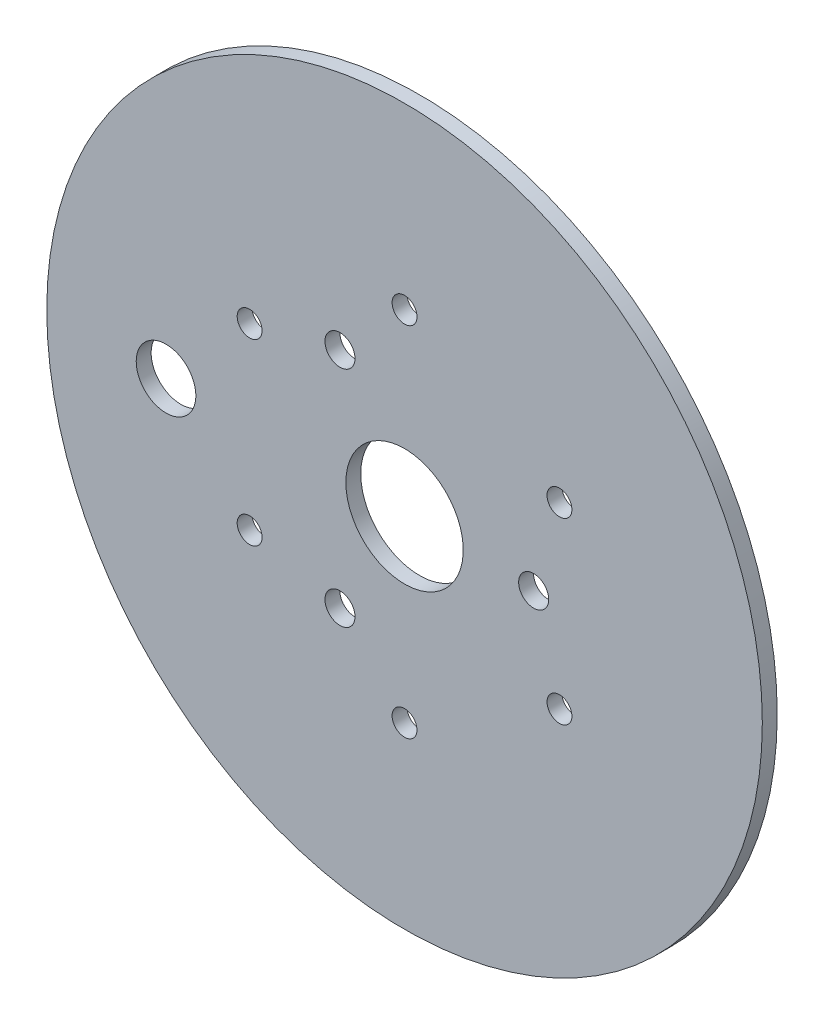
ISO-10303-21;
HEADER;
FILE_DESCRIPTION(('STEP AP214'),'2;1');
FILE_NAME('part.step','',(''),(''),'','','');
FILE_SCHEMA(('AUTOMOTIVE_DESIGN { 1 0 10303 214 1 1 1 1 }'));
ENDSEC;
DATA;
#1=APPLICATION_CONTEXT('core data for automotive mechanical design processes');
#2=APPLICATION_PROTOCOL_DEFINITION('international standard','automotive_design',2000,#1);
#3=PRODUCT_CONTEXT('',#1,'mechanical');
#4=PRODUCT('Part','Part','',(#3));
#5=PRODUCT_RELATED_PRODUCT_CATEGORY('part','',(#4));
#6=PRODUCT_DEFINITION_FORMATION('','',#4);
#7=PRODUCT_DEFINITION_CONTEXT('part definition',#1,'design');
#8=PRODUCT_DEFINITION('design','',#6,#7);
#9=PRODUCT_DEFINITION_SHAPE('','',#8);
#10=(LENGTH_UNIT() NAMED_UNIT(*) SI_UNIT(.MILLI.,.METRE.));
#11=(NAMED_UNIT(*) PLANE_ANGLE_UNIT() SI_UNIT($,.RADIAN.));
#12=(NAMED_UNIT(*) SI_UNIT($,.STERADIAN.) SOLID_ANGLE_UNIT());
#13=UNCERTAINTY_MEASURE_WITH_UNIT(LENGTH_MEASURE(1.E-05),#10,'distance_accuracy_value','');
#14=(GEOMETRIC_REPRESENTATION_CONTEXT(3) GLOBAL_UNCERTAINTY_ASSIGNED_CONTEXT((#13)) GLOBAL_UNIT_ASSIGNED_CONTEXT((#10,
#11,#12)) REPRESENTATION_CONTEXT('',''));
#15=CARTESIAN_POINT('',(0.,0.,0.));
#16=DIRECTION('',(0.,0.,1.));
#17=DIRECTION('',(1.,0.,0.));
#18=AXIS2_PLACEMENT_3D('',#15,#16,#17);
#19=CARTESIAN_POINT('',(0.,0.,3.175));
#20=DIRECTION('',(0.,0.,-1.));
#21=DIRECTION('',(-1.,0.,0.));
#22=AXIS2_PLACEMENT_3D('',#19,#20,#21);
#23=CYLINDRICAL_SURFACE('',#22,76.2);
#24=CARTESIAN_POINT('',(0.,0.,3.175));
#25=DIRECTION('',(0.,0.,1.));
#26=DIRECTION('',(1.,0.,0.));
#27=AXIS2_PLACEMENT_3D('',#24,#25,#26);
#28=CIRCLE('',#27,76.2);
#29=CARTESIAN_POINT('',(76.2,0.,3.175));
#30=VERTEX_POINT('',#29);
#31=EDGE_CURVE('E10',#30,#30,#28,.T.);
#32=ORIENTED_EDGE('',*,*,#31,.F.);
#33=EDGE_LOOP('',(#32));
#34=FACE_BOUND('',#33,.T.);
#35=CARTESIAN_POINT('',(0.,0.,0.));
#36=DIRECTION('',(0.,0.,1.));
#37=DIRECTION('',(1.,0.,0.));
#38=AXIS2_PLACEMENT_3D('',#35,#36,#37);
#39=CIRCLE('',#38,76.2);
#40=CARTESIAN_POINT('',(76.2,0.,0.));
#41=VERTEX_POINT('',#40);
#42=EDGE_CURVE('E44',#41,#41,#39,.T.);
#43=ORIENTED_EDGE('',*,*,#42,.T.);
#44=EDGE_LOOP('',(#43));
#45=FACE_BOUND('',#44,.T.);
#46=ADVANCED_FACE('F36',(#34,#45),#23,.T.);
#47=CARTESIAN_POINT('',(0.,0.,3.175));
#48=DIRECTION('',(0.,0.,1.));
#49=DIRECTION('',(1.,0.,0.));
#50=AXIS2_PLACEMENT_3D('',#47,#48,#49);
#51=PLANE('',#50);
#52=CARTESIAN_POINT('',(-50.8,0.,3.175));
#53=DIRECTION('',(0.,0.,-1.));
#54=DIRECTION('',(-1.,0.,0.));
#55=AXIS2_PLACEMENT_3D('',#52,#53,#54);
#56=CIRCLE('',#55,6.35);
#57=CARTESIAN_POINT('',(-57.15,0.,3.175));
#58=VERTEX_POINT('',#57);
#59=EDGE_CURVE('E273',#58,#58,#56,.T.);
#60=ORIENTED_EDGE('',*,*,#59,.T.);
#61=EDGE_LOOP('',(#60));
#62=FACE_BOUND('',#61,.T.);
#63=CARTESIAN_POINT('',(0.,0.,3.175));
#64=DIRECTION('',(0.,0.,-1.));
#65=DIRECTION('',(-1.,0.,0.));
#66=AXIS2_PLACEMENT_3D('',#63,#64,#65);
#67=CIRCLE('',#66,12.5);
#68=CARTESIAN_POINT('',(-12.5,0.,3.175));
#69=VERTEX_POINT('',#68);
#70=EDGE_CURVE('E283',#69,#69,#67,.T.);
#71=ORIENTED_EDGE('',*,*,#70,.T.);
#72=EDGE_LOOP('',(#71));
#73=FACE_BOUND('',#72,.T.);
#74=CARTESIAN_POINT('',(32.9955678841869,19.0500000000004,3.175));
#75=DIRECTION('',(0.,0.,1.));
#76=DIRECTION('',(1.,0.,0.));
#77=AXIS2_PLACEMENT_3D('',#74,#75,#76);
#78=CIRCLE('',#77,2.64999999999999);
#79=CARTESIAN_POINT('',(35.6455678841869,19.0500000000004,3.175));
#80=VERTEX_POINT('',#79);
#81=EDGE_CURVE('E96',#80,#80,#78,.T.);
#82=ORIENTED_EDGE('',*,*,#81,.F.);
#83=EDGE_LOOP('',(#82));
#84=FACE_BOUND('',#83,.T.);
#85=CARTESIAN_POINT('',(32.9955678841873,-19.0499999999997,3.175));
#86=DIRECTION('',(0.,0.,1.));
#87=DIRECTION('',(1.,0.,0.));
#88=AXIS2_PLACEMENT_3D('',#85,#86,#87);
#89=CIRCLE('',#88,2.64999999999999);
#90=CARTESIAN_POINT('',(35.6455678841873,-19.0499999999997,3.175));
#91=VERTEX_POINT('',#90);
#92=EDGE_CURVE('E83',#91,#91,#89,.T.);
#93=ORIENTED_EDGE('',*,*,#92,.F.);
#94=EDGE_LOOP('',(#93));
#95=FACE_BOUND('',#94,.T.);
#96=CARTESIAN_POINT('',(0.,-38.1,3.175));
#97=DIRECTION('',(0.,0.,1.));
#98=DIRECTION('',(1.,0.,0.));
#99=AXIS2_PLACEMENT_3D('',#96,#97,#98);
#100=CIRCLE('',#99,2.64999999999999);
#101=CARTESIAN_POINT('',(2.64999999999999,-38.1,3.175));
#102=VERTEX_POINT('',#101);
#103=EDGE_CURVE('E79',#102,#102,#100,.T.);
#104=ORIENTED_EDGE('',*,*,#103,.F.);
#105=EDGE_LOOP('',(#104));
#106=FACE_BOUND('',#105,.T.);
#107=CARTESIAN_POINT('',(-32.995567884187,-19.0500000000002,3.175));
#108=DIRECTION('',(0.,0.,1.));
#109=DIRECTION('',(1.,0.,0.));
#110=AXIS2_PLACEMENT_3D('',#107,#108,#109);
#111=CIRCLE('',#110,2.64999999999999);
#112=CARTESIAN_POINT('',(-30.345567884187,-19.0500000000002,3.175));
#113=VERTEX_POINT('',#112);
#114=EDGE_CURVE('E78',#113,#113,#111,.T.);
#115=ORIENTED_EDGE('',*,*,#114,.F.);
#116=EDGE_LOOP('',(#115));
#117=FACE_BOUND('',#116,.T.);
#118=CARTESIAN_POINT('',(-32.9955678841872,19.0499999999999,3.175));
#119=DIRECTION('',(0.,0.,1.));
#120=DIRECTION('',(1.,0.,0.));
#121=AXIS2_PLACEMENT_3D('',#118,#119,#120);
#122=CIRCLE('',#121,2.64999999999999);
#123=CARTESIAN_POINT('',(-30.3455678841872,19.0499999999999,3.175));
#124=VERTEX_POINT('',#123);
#125=EDGE_CURVE('E74',#124,#124,#122,.T.);
#126=ORIENTED_EDGE('',*,*,#125,.F.);
#127=EDGE_LOOP('',(#126));
#128=FACE_BOUND('',#127,.T.);
#129=CARTESIAN_POINT('',(27.5,2.9316826744008E-13,3.175));
#130=DIRECTION('',(0.,0.,1.));
#131=DIRECTION('',(1.,0.,0.));
#132=AXIS2_PLACEMENT_3D('',#129,#130,#131);
#133=CIRCLE('',#132,3.2);
#134=CARTESIAN_POINT('',(30.7,2.9316826744008E-13,3.175));
#135=VERTEX_POINT('',#134);
#136=EDGE_CURVE('E69',#135,#135,#133,.T.);
#137=ORIENTED_EDGE('',*,*,#136,.F.);
#138=EDGE_LOOP('',(#137));
#139=FACE_BOUND('',#138,.T.);
#140=CARTESIAN_POINT('',(-13.7499999999999,-23.8156986040721,3.175));
#141=DIRECTION('',(0.,0.,1.));
#142=DIRECTION('',(1.,0.,0.));
#143=AXIS2_PLACEMENT_3D('',#140,#141,#142);
#144=CIRCLE('',#143,3.2);
#145=CARTESIAN_POINT('',(-10.5499999999999,-23.8156986040721,3.175));
#146=VERTEX_POINT('',#145);
#147=EDGE_CURVE('E68',#146,#146,#144,.T.);
#148=ORIENTED_EDGE('',*,*,#147,.F.);
#149=EDGE_LOOP('',(#148));
#150=FACE_BOUND('',#149,.T.);
#151=CARTESIAN_POINT('',(-13.75,23.815698604072,3.175));
#152=DIRECTION('',(0.,0.,1.));
#153=DIRECTION('',(1.,0.,0.));
#154=AXIS2_PLACEMENT_3D('',#151,#152,#153);
#155=CIRCLE('',#154,3.2);
#156=CARTESIAN_POINT('',(-10.55,23.815698604072,3.175));
#157=VERTEX_POINT('',#156);
#158=EDGE_CURVE('E63',#157,#157,#155,.T.);
#159=ORIENTED_EDGE('',*,*,#158,.F.);
#160=EDGE_LOOP('',(#159));
#161=FACE_BOUND('',#160,.T.);
#162=CARTESIAN_POINT('',(0.,38.1,3.175));
#163=DIRECTION('',(0.,0.,1.));
#164=DIRECTION('',(1.,0.,0.));
#165=AXIS2_PLACEMENT_3D('',#162,#163,#164);
#166=CIRCLE('',#165,2.64999999999999);
#167=CARTESIAN_POINT('',(2.64999999999999,38.1,3.175));
#168=VERTEX_POINT('',#167);
#169=EDGE_CURVE('E53',#168,#168,#166,.T.);
#170=ORIENTED_EDGE('',*,*,#169,.F.);
#171=EDGE_LOOP('',(#170));
#172=FACE_BOUND('',#171,.T.);
#173=ORIENTED_EDGE('',*,*,#31,.T.);
#174=EDGE_LOOP('',(#173));
#175=FACE_BOUND('',#174,.T.);
#176=ADVANCED_FACE('F126',(#62,#73,#84,#95,#106,#117,#128,#139,#150,#161,#172,#175),#51,.T.);
#177=CARTESIAN_POINT('',(0.,0.,0.));
#178=DIRECTION('',(0.,0.,1.));
#179=DIRECTION('',(1.,0.,0.));
#180=AXIS2_PLACEMENT_3D('',#177,#178,#179);
#181=PLANE('',#180);
#182=CARTESIAN_POINT('',(-50.8,0.,0.));
#183=DIRECTION('',(0.,0.,-1.));
#184=DIRECTION('',(-1.,0.,0.));
#185=AXIS2_PLACEMENT_3D('',#182,#183,#184);
#186=CIRCLE('',#185,6.35);
#187=CARTESIAN_POINT('',(-57.15,0.,0.));
#188=VERTEX_POINT('',#187);
#189=EDGE_CURVE('E276',#188,#188,#186,.T.);
#190=ORIENTED_EDGE('',*,*,#189,.F.);
#191=EDGE_LOOP('',(#190));
#192=FACE_BOUND('',#191,.T.);
#193=CARTESIAN_POINT('',(0.,0.,0.));
#194=DIRECTION('',(0.,0.,-1.));
#195=DIRECTION('',(-1.,0.,0.));
#196=AXIS2_PLACEMENT_3D('',#193,#194,#195);
#197=CIRCLE('',#196,12.5);
#198=CARTESIAN_POINT('',(-12.5,0.,0.));
#199=VERTEX_POINT('',#198);
#200=EDGE_CURVE('E280',#199,#199,#197,.T.);
#201=ORIENTED_EDGE('',*,*,#200,.F.);
#202=EDGE_LOOP('',(#201));
#203=FACE_BOUND('',#202,.T.);
#204=CARTESIAN_POINT('',(32.9955678841869,19.0500000000004,0.));
#205=DIRECTION('',(0.,0.,1.));
#206=DIRECTION('',(1.,0.,0.));
#207=AXIS2_PLACEMENT_3D('',#204,#205,#206);
#208=CIRCLE('',#207,2.64999999999999);
#209=CARTESIAN_POINT('',(35.6455678841869,19.0500000000004,0.));
#210=VERTEX_POINT('',#209);
#211=EDGE_CURVE('E39',#210,#210,#208,.T.);
#212=ORIENTED_EDGE('',*,*,#211,.T.);
#213=EDGE_LOOP('',(#212));
#214=FACE_BOUND('',#213,.T.);
#215=CARTESIAN_POINT('',(32.9955678841873,-19.0499999999997,0.));
#216=DIRECTION('',(0.,0.,1.));
#217=DIRECTION('',(1.,0.,0.));
#218=AXIS2_PLACEMENT_3D('',#215,#216,#217);
#219=CIRCLE('',#218,2.64999999999999);
#220=CARTESIAN_POINT('',(35.6455678841873,-19.0499999999997,0.));
#221=VERTEX_POINT('',#220);
#222=EDGE_CURVE('E80',#221,#221,#219,.T.);
#223=ORIENTED_EDGE('',*,*,#222,.T.);
#224=EDGE_LOOP('',(#223));
#225=FACE_BOUND('',#224,.T.);
#226=CARTESIAN_POINT('',(0.,-38.1,0.));
#227=DIRECTION('',(0.,0.,1.));
#228=DIRECTION('',(1.,0.,0.));
#229=AXIS2_PLACEMENT_3D('',#226,#227,#228);
#230=CIRCLE('',#229,2.64999999999999);
#231=CARTESIAN_POINT('',(2.64999999999999,-38.1,0.));
#232=VERTEX_POINT('',#231);
#233=EDGE_CURVE('E75',#232,#232,#230,.T.);
#234=ORIENTED_EDGE('',*,*,#233,.T.);
#235=EDGE_LOOP('',(#234));
#236=FACE_BOUND('',#235,.T.);
#237=CARTESIAN_POINT('',(-32.995567884187,-19.0500000000002,0.));
#238=DIRECTION('',(0.,0.,1.));
#239=DIRECTION('',(1.,0.,0.));
#240=AXIS2_PLACEMENT_3D('',#237,#238,#239);
#241=CIRCLE('',#240,2.64999999999999);
#242=CARTESIAN_POINT('',(-30.345567884187,-19.0500000000002,0.));
#243=VERTEX_POINT('',#242);
#244=EDGE_CURVE('E103',#243,#243,#241,.T.);
#245=ORIENTED_EDGE('',*,*,#244,.T.);
#246=EDGE_LOOP('',(#245));
#247=FACE_BOUND('',#246,.T.);
#248=CARTESIAN_POINT('',(-32.9955678841872,19.0499999999999,0.));
#249=DIRECTION('',(0.,0.,1.));
#250=DIRECTION('',(1.,0.,0.));
#251=AXIS2_PLACEMENT_3D('',#248,#249,#250);
#252=CIRCLE('',#251,2.64999999999999);
#253=CARTESIAN_POINT('',(-30.3455678841872,19.0499999999999,0.));
#254=VERTEX_POINT('',#253);
#255=EDGE_CURVE('E70',#254,#254,#252,.T.);
#256=ORIENTED_EDGE('',*,*,#255,.T.);
#257=EDGE_LOOP('',(#256));
#258=FACE_BOUND('',#257,.T.);
#259=CARTESIAN_POINT('',(27.5,2.9316826744008E-13,0.));
#260=DIRECTION('',(0.,0.,1.));
#261=DIRECTION('',(1.,0.,0.));
#262=AXIS2_PLACEMENT_3D('',#259,#260,#261);
#263=CIRCLE('',#262,3.2);
#264=CARTESIAN_POINT('',(30.7,2.9316826744008E-13,0.));
#265=VERTEX_POINT('',#264);
#266=EDGE_CURVE('E64',#265,#265,#263,.T.);
#267=ORIENTED_EDGE('',*,*,#266,.T.);
#268=EDGE_LOOP('',(#267));
#269=FACE_BOUND('',#268,.T.);
#270=CARTESIAN_POINT('',(-13.7499999999999,-23.8156986040721,0.));
#271=DIRECTION('',(0.,0.,1.));
#272=DIRECTION('',(1.,0.,0.));
#273=AXIS2_PLACEMENT_3D('',#270,#271,#272);
#274=CIRCLE('',#273,3.2);
#275=CARTESIAN_POINT('',(-10.5499999999999,-23.8156986040721,0.));
#276=VERTEX_POINT('',#275);
#277=EDGE_CURVE('E116',#276,#276,#274,.T.);
#278=ORIENTED_EDGE('',*,*,#277,.T.);
#279=EDGE_LOOP('',(#278));
#280=FACE_BOUND('',#279,.T.);
#281=CARTESIAN_POINT('',(-13.75,23.815698604072,0.));
#282=DIRECTION('',(0.,0.,1.));
#283=DIRECTION('',(1.,0.,0.));
#284=AXIS2_PLACEMENT_3D('',#281,#282,#283);
#285=CIRCLE('',#284,3.2);
#286=CARTESIAN_POINT('',(-10.55,23.815698604072,0.));
#287=VERTEX_POINT('',#286);
#288=EDGE_CURVE('E59',#287,#287,#285,.T.);
#289=ORIENTED_EDGE('',*,*,#288,.T.);
#290=EDGE_LOOP('',(#289));
#291=FACE_BOUND('',#290,.T.);
#292=CARTESIAN_POINT('',(0.,38.1,0.));
#293=DIRECTION('',(0.,0.,1.));
#294=DIRECTION('',(1.,0.,0.));
#295=AXIS2_PLACEMENT_3D('',#292,#293,#294);
#296=CIRCLE('',#295,2.64999999999999);
#297=CARTESIAN_POINT('',(2.64999999999999,38.1,0.));
#298=VERTEX_POINT('',#297);
#299=EDGE_CURVE('E50',#298,#298,#296,.T.);
#300=ORIENTED_EDGE('',*,*,#299,.T.);
#301=EDGE_LOOP('',(#300));
#302=FACE_BOUND('',#301,.T.);
#303=ORIENTED_EDGE('',*,*,#42,.F.);
#304=EDGE_LOOP('',(#303));
#305=FACE_BOUND('',#304,.T.);
#306=ADVANCED_FACE('F129',(#192,#203,#214,#225,#236,#247,#258,#269,#280,#291,#302,#305),#181,.F.);
#307=CARTESIAN_POINT('',(0.,38.1,3.175));
#308=DIRECTION('',(0.,0.,1.));
#309=DIRECTION('',(1.,0.,0.));
#310=AXIS2_PLACEMENT_3D('',#307,#308,#309);
#311=CYLINDRICAL_SURFACE('',#310,2.64999999999999);
#312=ORIENTED_EDGE('',*,*,#169,.T.);
#313=EDGE_LOOP('',(#312));
#314=FACE_BOUND('',#313,.T.);
#315=ORIENTED_EDGE('',*,*,#299,.F.);
#316=EDGE_LOOP('',(#315));
#317=FACE_BOUND('',#316,.T.);
#318=ADVANCED_FACE('F136',(#314,#317),#311,.F.);
#319=CARTESIAN_POINT('',(-13.75,23.815698604072,3.175));
#320=DIRECTION('',(0.,0.,1.));
#321=DIRECTION('',(1.,0.,0.));
#322=AXIS2_PLACEMENT_3D('',#319,#320,#321);
#323=CYLINDRICAL_SURFACE('',#322,3.2);
#324=ORIENTED_EDGE('',*,*,#158,.T.);
#325=EDGE_LOOP('',(#324));
#326=FACE_BOUND('',#325,.T.);
#327=ORIENTED_EDGE('',*,*,#288,.F.);
#328=EDGE_LOOP('',(#327));
#329=FACE_BOUND('',#328,.T.);
#330=ADVANCED_FACE('F123',(#326,#329),#323,.F.);
#331=CARTESIAN_POINT('',(-13.7499999999999,-23.8156986040721,3.175));
#332=DIRECTION('',(0.,0.,1.));
#333=DIRECTION('',(1.,0.,0.));
#334=AXIS2_PLACEMENT_3D('',#331,#332,#333);
#335=CYLINDRICAL_SURFACE('',#334,3.2);
#336=ORIENTED_EDGE('',*,*,#147,.T.);
#337=EDGE_LOOP('',(#336));
#338=FACE_BOUND('',#337,.T.);
#339=ORIENTED_EDGE('',*,*,#277,.F.);
#340=EDGE_LOOP('',(#339));
#341=FACE_BOUND('',#340,.T.);
#342=ADVANCED_FACE('F171',(#338,#341),#335,.F.);
#343=CARTESIAN_POINT('',(27.5,2.9316826744008E-13,3.175));
#344=DIRECTION('',(0.,0.,1.));
#345=DIRECTION('',(1.,0.,0.));
#346=AXIS2_PLACEMENT_3D('',#343,#344,#345);
#347=CYLINDRICAL_SURFACE('',#346,3.2);
#348=ORIENTED_EDGE('',*,*,#136,.T.);
#349=EDGE_LOOP('',(#348));
#350=FACE_BOUND('',#349,.T.);
#351=ORIENTED_EDGE('',*,*,#266,.F.);
#352=EDGE_LOOP('',(#351));
#353=FACE_BOUND('',#352,.T.);
#354=ADVANCED_FACE('F178',(#350,#353),#347,.F.);
#355=CARTESIAN_POINT('',(-32.9955678841872,19.0499999999999,3.175));
#356=DIRECTION('',(0.,0.,1.));
#357=DIRECTION('',(1.,0.,0.));
#358=AXIS2_PLACEMENT_3D('',#355,#356,#357);
#359=CYLINDRICAL_SURFACE('',#358,2.64999999999999);
#360=ORIENTED_EDGE('',*,*,#125,.T.);
#361=EDGE_LOOP('',(#360));
#362=FACE_BOUND('',#361,.T.);
#363=ORIENTED_EDGE('',*,*,#255,.F.);
#364=EDGE_LOOP('',(#363));
#365=FACE_BOUND('',#364,.T.);
#366=ADVANCED_FACE('F186',(#362,#365),#359,.F.);
#367=CARTESIAN_POINT('',(-32.995567884187,-19.0500000000002,3.175));
#368=DIRECTION('',(0.,0.,1.));
#369=DIRECTION('',(1.,0.,0.));
#370=AXIS2_PLACEMENT_3D('',#367,#368,#369);
#371=CYLINDRICAL_SURFACE('',#370,2.64999999999999);
#372=ORIENTED_EDGE('',*,*,#114,.T.);
#373=EDGE_LOOP('',(#372));
#374=FACE_BOUND('',#373,.T.);
#375=ORIENTED_EDGE('',*,*,#244,.F.);
#376=EDGE_LOOP('',(#375));
#377=FACE_BOUND('',#376,.T.);
#378=ADVANCED_FACE('F194',(#374,#377),#371,.F.);
#379=CARTESIAN_POINT('',(0.,-38.1,3.175));
#380=DIRECTION('',(0.,0.,1.));
#381=DIRECTION('',(1.,0.,0.));
#382=AXIS2_PLACEMENT_3D('',#379,#380,#381);
#383=CYLINDRICAL_SURFACE('',#382,2.64999999999999);
#384=ORIENTED_EDGE('',*,*,#103,.T.);
#385=EDGE_LOOP('',(#384));
#386=FACE_BOUND('',#385,.T.);
#387=ORIENTED_EDGE('',*,*,#233,.F.);
#388=EDGE_LOOP('',(#387));
#389=FACE_BOUND('',#388,.T.);
#390=ADVANCED_FACE('F202',(#386,#389),#383,.F.);
#391=CARTESIAN_POINT('',(32.9955678841873,-19.0499999999997,3.175));
#392=DIRECTION('',(0.,0.,1.));
#393=DIRECTION('',(1.,0.,0.));
#394=AXIS2_PLACEMENT_3D('',#391,#392,#393);
#395=CYLINDRICAL_SURFACE('',#394,2.64999999999999);
#396=ORIENTED_EDGE('',*,*,#92,.T.);
#397=EDGE_LOOP('',(#396));
#398=FACE_BOUND('',#397,.T.);
#399=ORIENTED_EDGE('',*,*,#222,.F.);
#400=EDGE_LOOP('',(#399));
#401=FACE_BOUND('',#400,.T.);
#402=ADVANCED_FACE('F210',(#398,#401),#395,.F.);
#403=CARTESIAN_POINT('',(32.9955678841869,19.0500000000004,3.175));
#404=DIRECTION('',(0.,0.,1.));
#405=DIRECTION('',(1.,0.,0.));
#406=AXIS2_PLACEMENT_3D('',#403,#404,#405);
#407=CYLINDRICAL_SURFACE('',#406,2.64999999999999);
#408=ORIENTED_EDGE('',*,*,#81,.T.);
#409=EDGE_LOOP('',(#408));
#410=FACE_BOUND('',#409,.T.);
#411=ORIENTED_EDGE('',*,*,#211,.F.);
#412=EDGE_LOOP('',(#411));
#413=FACE_BOUND('',#412,.T.);
#414=ADVANCED_FACE('F218',(#410,#413),#407,.F.);
#415=CARTESIAN_POINT('',(0.,0.,3.175));
#416=DIRECTION('',(0.,0.,-1.));
#417=DIRECTION('',(-1.,0.,0.));
#418=AXIS2_PLACEMENT_3D('',#415,#416,#417);
#419=CYLINDRICAL_SURFACE('',#418,12.5);
#420=ORIENTED_EDGE('',*,*,#70,.F.);
#421=EDGE_LOOP('',(#420));
#422=FACE_BOUND('',#421,.T.);
#423=ORIENTED_EDGE('',*,*,#200,.T.);
#424=EDGE_LOOP('',(#423));
#425=FACE_BOUND('',#424,.T.);
#426=ADVANCED_FACE('F225',(#422,#425),#419,.F.);
#427=CARTESIAN_POINT('',(-50.8,0.,3.175));
#428=DIRECTION('',(0.,0.,-1.));
#429=DIRECTION('',(-1.,0.,0.));
#430=AXIS2_PLACEMENT_3D('',#427,#428,#429);
#431=CYLINDRICAL_SURFACE('',#430,6.35);
#432=ORIENTED_EDGE('',*,*,#59,.F.);
#433=EDGE_LOOP('',(#432));
#434=FACE_BOUND('',#433,.T.);
#435=ORIENTED_EDGE('',*,*,#189,.T.);
#436=EDGE_LOOP('',(#435));
#437=FACE_BOUND('',#436,.T.);
#438=ADVANCED_FACE('F232',(#434,#437),#431,.F.);
#439=CLOSED_SHELL('',(#46,#176,#306,#318,#330,#342,#354,#366,#378,#390,#402,#414,#426,#438));
#440=MANIFOLD_SOLID_BREP('B2',#439);
#441=ADVANCED_BREP_SHAPE_REPRESENTATION('',(#18,#440),#14);
#442=SHAPE_DEFINITION_REPRESENTATION(#9,#441);
ENDSEC;
END-ISO-10303-21;
